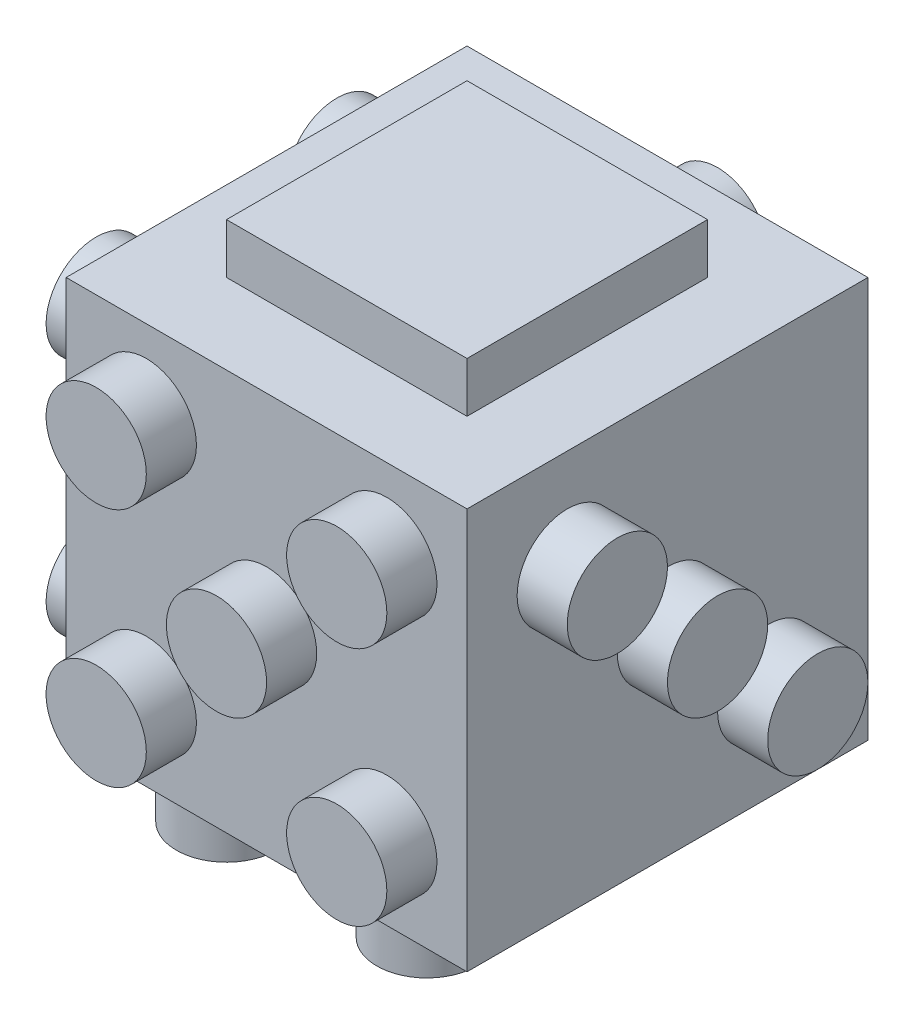
ISO-10303-21;
HEADER;
FILE_DESCRIPTION(('STEP AP214'),'2;1');
FILE_NAME('part.step','',(''),(''),'','','');
FILE_SCHEMA(('AUTOMOTIVE_DESIGN { 1 0 10303 214 1 1 1 1 }'));
ENDSEC;
DATA;
#1=APPLICATION_CONTEXT('core data for automotive mechanical design processes');
#2=APPLICATION_PROTOCOL_DEFINITION('international standard','automotive_design',2000,#1);
#3=PRODUCT_CONTEXT('',#1,'mechanical');
#4=PRODUCT('Part','Part','',(#3));
#5=PRODUCT_RELATED_PRODUCT_CATEGORY('part','',(#4));
#6=PRODUCT_DEFINITION_FORMATION('','',#4);
#7=PRODUCT_DEFINITION_CONTEXT('part definition',#1,'design');
#8=PRODUCT_DEFINITION('design','',#6,#7);
#9=PRODUCT_DEFINITION_SHAPE('','',#8);
#10=(LENGTH_UNIT() NAMED_UNIT(*) SI_UNIT(.MILLI.,.METRE.));
#11=(NAMED_UNIT(*) PLANE_ANGLE_UNIT() SI_UNIT($,.RADIAN.));
#12=(NAMED_UNIT(*) SI_UNIT($,.STERADIAN.) SOLID_ANGLE_UNIT());
#13=UNCERTAINTY_MEASURE_WITH_UNIT(LENGTH_MEASURE(1.E-05),#10,'distance_accuracy_value','');
#14=(GEOMETRIC_REPRESENTATION_CONTEXT(3) GLOBAL_UNCERTAINTY_ASSIGNED_CONTEXT((#13)) GLOBAL_UNIT_ASSIGNED_CONTEXT((#10,
#11,#12)) REPRESENTATION_CONTEXT('',''));
#15=CARTESIAN_POINT('',(0.,0.,0.));
#16=DIRECTION('',(0.,0.,1.));
#17=DIRECTION('',(1.,0.,0.));
#18=AXIS2_PLACEMENT_3D('',#15,#16,#17);
#19=CARTESIAN_POINT('',(0.,2.5,0.));
#20=DIRECTION('',(0.,1.,0.));
#21=DIRECTION('',(0.,0.,1.));
#22=AXIS2_PLACEMENT_3D('',#19,#20,#21);
#23=PLANE('',#22);
#24=CARTESIAN_POINT('',(5.,2.5,7.));
#25=DIRECTION('',(0.,1.,0.));
#26=DIRECTION('',(0.,0.,1.));
#27=AXIS2_PLACEMENT_3D('',#24,#25,#26);
#28=CIRCLE('',#27,2.5);
#29=CARTESIAN_POINT('',(5.,2.5,9.5));
#30=VERTEX_POINT('',#29);
#31=EDGE_CURVE('E55',#30,#30,#28,.F.);
#32=ORIENTED_EDGE('',*,*,#31,.F.);
#33=EDGE_LOOP('',(#32));
#34=FACE_BOUND('',#33,.T.);
#35=ADVANCED_FACE('F48',(#34),#23,.T.);
#36=CARTESIAN_POINT('',(5.,0.,7.));
#37=DIRECTION('',(0.,-1.,0.));
#38=DIRECTION('',(0.,0.,-1.));
#39=AXIS2_PLACEMENT_3D('',#36,#37,#38);
#40=PLANE('',#39);
#41=CARTESIAN_POINT('',(5.,0.,7.));
#42=DIRECTION('',(0.,-1.,0.));
#43=DIRECTION('',(0.,0.,-1.));
#44=AXIS2_PLACEMENT_3D('',#41,#42,#43);
#45=CIRCLE('',#44,2.5);
#46=CARTESIAN_POINT('',(5.,0.,4.5));
#47=VERTEX_POINT('',#46);
#48=EDGE_CURVE('E11',#47,#47,#45,.T.);
#49=ORIENTED_EDGE('',*,*,#48,.T.);
#50=EDGE_LOOP('',(#49));
#51=FACE_BOUND('',#50,.T.);
#52=ADVANCED_FACE('F50',(#51),#40,.T.);
#53=CARTESIAN_POINT('',(5.,9.57106781186548,7.));
#54=DIRECTION('',(0.,-1.,0.));
#55=DIRECTION('',(0.,0.,-1.));
#56=AXIS2_PLACEMENT_3D('',#53,#54,#55);
#57=CYLINDRICAL_SURFACE('',#56,2.5);
#58=ORIENTED_EDGE('',*,*,#48,.F.);
#59=EDGE_LOOP('',(#58));
#60=FACE_BOUND('',#59,.T.);
#61=ORIENTED_EDGE('',*,*,#31,.T.);
#62=EDGE_LOOP('',(#61));
#63=FACE_BOUND('',#62,.T.);
#64=ADVANCED_FACE('F61',(#60,#63),#57,.T.);
#65=CLOSED_SHELL('',(#35,#52,#64));
#66=MANIFOLD_SOLID_BREP('B2',#65);
#67=CARTESIAN_POINT('',(0.,2.5,0.));
#68=DIRECTION('',(0.,1.,0.));
#69=DIRECTION('',(0.,0.,1.));
#70=AXIS2_PLACEMENT_3D('',#67,#68,#69);
#71=PLANE('',#70);
#72=CARTESIAN_POINT('',(5.,2.5,0.));
#73=DIRECTION('',(0.,1.,0.));
#74=DIRECTION('',(0.,0.,1.));
#75=AXIS2_PLACEMENT_3D('',#72,#73,#74);
#76=CIRCLE('',#75,2.5);
#77=CARTESIAN_POINT('',(5.,2.5,2.5));
#78=VERTEX_POINT('',#77);
#79=EDGE_CURVE('E104',#78,#78,#76,.F.);
#80=ORIENTED_EDGE('',*,*,#79,.F.);
#81=EDGE_LOOP('',(#80));
#82=FACE_BOUND('',#81,.T.);
#83=ADVANCED_FACE('F97',(#82),#71,.T.);
#84=CARTESIAN_POINT('',(5.,0.,0.));
#85=DIRECTION('',(0.,-1.,0.));
#86=DIRECTION('',(0.,0.,-1.));
#87=AXIS2_PLACEMENT_3D('',#84,#85,#86);
#88=PLANE('',#87);
#89=CARTESIAN_POINT('',(5.,0.,0.));
#90=DIRECTION('',(0.,-1.,0.));
#91=DIRECTION('',(0.,0.,-1.));
#92=AXIS2_PLACEMENT_3D('',#89,#90,#91);
#93=CIRCLE('',#92,2.5);
#94=CARTESIAN_POINT('',(5.,0.,-2.5));
#95=VERTEX_POINT('',#94);
#96=EDGE_CURVE('E47',#95,#95,#93,.T.);
#97=ORIENTED_EDGE('',*,*,#96,.T.);
#98=EDGE_LOOP('',(#97));
#99=FACE_BOUND('',#98,.T.);
#100=ADVANCED_FACE('F99',(#99),#88,.T.);
#101=CARTESIAN_POINT('',(5.,9.57106781186548,0.));
#102=DIRECTION('',(0.,-1.,0.));
#103=DIRECTION('',(0.,0.,-1.));
#104=AXIS2_PLACEMENT_3D('',#101,#102,#103);
#105=CYLINDRICAL_SURFACE('',#104,2.5);
#106=ORIENTED_EDGE('',*,*,#96,.F.);
#107=EDGE_LOOP('',(#106));
#108=FACE_BOUND('',#107,.T.);
#109=ORIENTED_EDGE('',*,*,#79,.T.);
#110=EDGE_LOOP('',(#109));
#111=FACE_BOUND('',#110,.T.);
#112=ADVANCED_FACE('F110',(#108,#111),#105,.T.);
#113=CLOSED_SHELL('',(#83,#100,#112));
#114=MANIFOLD_SOLID_BREP('B6',#113);
#115=CARTESIAN_POINT('',(0.,2.5,0.));
#116=DIRECTION('',(0.,1.,0.));
#117=DIRECTION('',(0.,0.,1.));
#118=AXIS2_PLACEMENT_3D('',#115,#116,#117);
#119=PLANE('',#118);
#120=CARTESIAN_POINT('',(5.,2.5,-7.));
#121=DIRECTION('',(0.,1.,0.));
#122=DIRECTION('',(0.,0.,1.));
#123=AXIS2_PLACEMENT_3D('',#120,#121,#122);
#124=CIRCLE('',#123,2.5);
#125=CARTESIAN_POINT('',(5.,2.5,-4.5));
#126=VERTEX_POINT('',#125);
#127=EDGE_CURVE('E153',#126,#126,#124,.F.);
#128=ORIENTED_EDGE('',*,*,#127,.F.);
#129=EDGE_LOOP('',(#128));
#130=FACE_BOUND('',#129,.T.);
#131=ADVANCED_FACE('F146',(#130),#119,.T.);
#132=CARTESIAN_POINT('',(5.,0.,-7.));
#133=DIRECTION('',(0.,-1.,0.));
#134=DIRECTION('',(0.,0.,-1.));
#135=AXIS2_PLACEMENT_3D('',#132,#133,#134);
#136=PLANE('',#135);
#137=CARTESIAN_POINT('',(5.,0.,-7.));
#138=DIRECTION('',(0.,-1.,0.));
#139=DIRECTION('',(0.,0.,-1.));
#140=AXIS2_PLACEMENT_3D('',#137,#138,#139);
#141=CIRCLE('',#140,2.5);
#142=CARTESIAN_POINT('',(5.,0.,-9.5));
#143=VERTEX_POINT('',#142);
#144=EDGE_CURVE('E96',#143,#143,#141,.T.);
#145=ORIENTED_EDGE('',*,*,#144,.T.);
#146=EDGE_LOOP('',(#145));
#147=FACE_BOUND('',#146,.T.);
#148=ADVANCED_FACE('F148',(#147),#136,.T.);
#149=CARTESIAN_POINT('',(5.,9.57106781186548,-7.));
#150=DIRECTION('',(0.,-1.,0.));
#151=DIRECTION('',(0.,0.,-1.));
#152=AXIS2_PLACEMENT_3D('',#149,#150,#151);
#153=CYLINDRICAL_SURFACE('',#152,2.5);
#154=ORIENTED_EDGE('',*,*,#144,.F.);
#155=EDGE_LOOP('',(#154));
#156=FACE_BOUND('',#155,.T.);
#157=ORIENTED_EDGE('',*,*,#127,.T.);
#158=EDGE_LOOP('',(#157));
#159=FACE_BOUND('',#158,.T.);
#160=ADVANCED_FACE('F159',(#156,#159),#153,.T.);
#161=CLOSED_SHELL('',(#131,#148,#160));
#162=MANIFOLD_SOLID_BREP('B42',#161);
#163=CARTESIAN_POINT('',(0.,2.5,0.));
#164=DIRECTION('',(0.,1.,0.));
#165=DIRECTION('',(0.,0.,1.));
#166=AXIS2_PLACEMENT_3D('',#163,#164,#165);
#167=PLANE('',#166);
#168=CARTESIAN_POINT('',(-5.,2.5,7.));
#169=DIRECTION('',(0.,1.,0.));
#170=DIRECTION('',(0.,0.,1.));
#171=AXIS2_PLACEMENT_3D('',#168,#169,#170);
#172=CIRCLE('',#171,2.5);
#173=CARTESIAN_POINT('',(-5.,2.5,9.5));
#174=VERTEX_POINT('',#173);
#175=EDGE_CURVE('E202',#174,#174,#172,.F.);
#176=ORIENTED_EDGE('',*,*,#175,.F.);
#177=EDGE_LOOP('',(#176));
#178=FACE_BOUND('',#177,.T.);
#179=ADVANCED_FACE('F195',(#178),#167,.T.);
#180=CARTESIAN_POINT('',(-5.,0.,7.));
#181=DIRECTION('',(0.,-1.,0.));
#182=DIRECTION('',(0.,0.,-1.));
#183=AXIS2_PLACEMENT_3D('',#180,#181,#182);
#184=PLANE('',#183);
#185=CARTESIAN_POINT('',(-5.,0.,7.));
#186=DIRECTION('',(0.,-1.,0.));
#187=DIRECTION('',(0.,0.,-1.));
#188=AXIS2_PLACEMENT_3D('',#185,#186,#187);
#189=CIRCLE('',#188,2.5);
#190=CARTESIAN_POINT('',(-5.,0.,4.5));
#191=VERTEX_POINT('',#190);
#192=EDGE_CURVE('E145',#191,#191,#189,.T.);
#193=ORIENTED_EDGE('',*,*,#192,.T.);
#194=EDGE_LOOP('',(#193));
#195=FACE_BOUND('',#194,.T.);
#196=ADVANCED_FACE('F197',(#195),#184,.T.);
#197=CARTESIAN_POINT('',(-5.,9.57106781186548,7.));
#198=DIRECTION('',(0.,-1.,0.));
#199=DIRECTION('',(0.,0.,-1.));
#200=AXIS2_PLACEMENT_3D('',#197,#198,#199);
#201=CYLINDRICAL_SURFACE('',#200,2.5);
#202=ORIENTED_EDGE('',*,*,#192,.F.);
#203=EDGE_LOOP('',(#202));
#204=FACE_BOUND('',#203,.T.);
#205=ORIENTED_EDGE('',*,*,#175,.T.);
#206=EDGE_LOOP('',(#205));
#207=FACE_BOUND('',#206,.T.);
#208=ADVANCED_FACE('F208',(#204,#207),#201,.T.);
#209=CLOSED_SHELL('',(#179,#196,#208));
#210=MANIFOLD_SOLID_BREP('B91',#209);
#211=CARTESIAN_POINT('',(0.,2.5,0.));
#212=DIRECTION('',(0.,1.,0.));
#213=DIRECTION('',(0.,0.,1.));
#214=AXIS2_PLACEMENT_3D('',#211,#212,#213);
#215=PLANE('',#214);
#216=CARTESIAN_POINT('',(-5.,2.5,0.));
#217=DIRECTION('',(0.,1.,0.));
#218=DIRECTION('',(0.,0.,1.));
#219=AXIS2_PLACEMENT_3D('',#216,#217,#218);
#220=CIRCLE('',#219,2.5);
#221=CARTESIAN_POINT('',(-5.,2.5,2.5));
#222=VERTEX_POINT('',#221);
#223=EDGE_CURVE('E251',#222,#222,#220,.F.);
#224=ORIENTED_EDGE('',*,*,#223,.F.);
#225=EDGE_LOOP('',(#224));
#226=FACE_BOUND('',#225,.T.);
#227=ADVANCED_FACE('F244',(#226),#215,.T.);
#228=CARTESIAN_POINT('',(-5.,0.,0.));
#229=DIRECTION('',(0.,-1.,0.));
#230=DIRECTION('',(0.,0.,-1.));
#231=AXIS2_PLACEMENT_3D('',#228,#229,#230);
#232=PLANE('',#231);
#233=CARTESIAN_POINT('',(-5.,0.,0.));
#234=DIRECTION('',(0.,-1.,0.));
#235=DIRECTION('',(0.,0.,-1.));
#236=AXIS2_PLACEMENT_3D('',#233,#234,#235);
#237=CIRCLE('',#236,2.5);
#238=CARTESIAN_POINT('',(-5.,0.,-2.5));
#239=VERTEX_POINT('',#238);
#240=EDGE_CURVE('E194',#239,#239,#237,.T.);
#241=ORIENTED_EDGE('',*,*,#240,.T.);
#242=EDGE_LOOP('',(#241));
#243=FACE_BOUND('',#242,.T.);
#244=ADVANCED_FACE('F246',(#243),#232,.T.);
#245=CARTESIAN_POINT('',(-5.,9.57106781186548,0.));
#246=DIRECTION('',(0.,-1.,0.));
#247=DIRECTION('',(0.,0.,-1.));
#248=AXIS2_PLACEMENT_3D('',#245,#246,#247);
#249=CYLINDRICAL_SURFACE('',#248,2.5);
#250=ORIENTED_EDGE('',*,*,#240,.F.);
#251=EDGE_LOOP('',(#250));
#252=FACE_BOUND('',#251,.T.);
#253=ORIENTED_EDGE('',*,*,#223,.T.);
#254=EDGE_LOOP('',(#253));
#255=FACE_BOUND('',#254,.T.);
#256=ADVANCED_FACE('F257',(#252,#255),#249,.T.);
#257=CLOSED_SHELL('',(#227,#244,#256));
#258=MANIFOLD_SOLID_BREP('B140',#257);
#259=CARTESIAN_POINT('',(0.,2.5,0.));
#260=DIRECTION('',(0.,1.,0.));
#261=DIRECTION('',(0.,0.,1.));
#262=AXIS2_PLACEMENT_3D('',#259,#260,#261);
#263=PLANE('',#262);
#264=CARTESIAN_POINT('',(-5.,2.5,-7.));
#265=DIRECTION('',(0.,1.,0.));
#266=DIRECTION('',(0.,0.,1.));
#267=AXIS2_PLACEMENT_3D('',#264,#265,#266);
#268=CIRCLE('',#267,2.5);
#269=CARTESIAN_POINT('',(-5.,2.5,-4.5));
#270=VERTEX_POINT('',#269);
#271=EDGE_CURVE('E243',#270,#270,#268,.F.);
#272=ORIENTED_EDGE('',*,*,#271,.F.);
#273=EDGE_LOOP('',(#272));
#274=FACE_BOUND('',#273,.T.);
#275=ADVANCED_FACE('F294',(#274),#263,.T.);
#276=CARTESIAN_POINT('',(-5.,0.,-7.));
#277=DIRECTION('',(0.,-1.,0.));
#278=DIRECTION('',(0.,0.,-1.));
#279=AXIS2_PLACEMENT_3D('',#276,#277,#278);
#280=PLANE('',#279);
#281=CARTESIAN_POINT('',(-5.,0.,-7.));
#282=DIRECTION('',(0.,-1.,0.));
#283=DIRECTION('',(0.,0.,-1.));
#284=AXIS2_PLACEMENT_3D('',#281,#282,#283);
#285=CIRCLE('',#284,2.5);
#286=CARTESIAN_POINT('',(-5.,0.,-9.5));
#287=VERTEX_POINT('',#286);
#288=EDGE_CURVE('E300',#287,#287,#285,.T.);
#289=ORIENTED_EDGE('',*,*,#288,.T.);
#290=EDGE_LOOP('',(#289));
#291=FACE_BOUND('',#290,.T.);
#292=ADVANCED_FACE('F306',(#291),#280,.T.);
#293=CARTESIAN_POINT('',(-5.,9.57106781186548,-7.));
#294=DIRECTION('',(0.,-1.,0.));
#295=DIRECTION('',(0.,0.,-1.));
#296=AXIS2_PLACEMENT_3D('',#293,#294,#295);
#297=CYLINDRICAL_SURFACE('',#296,2.5);
#298=ORIENTED_EDGE('',*,*,#288,.F.);
#299=EDGE_LOOP('',(#298));
#300=FACE_BOUND('',#299,.T.);
#301=ORIENTED_EDGE('',*,*,#271,.T.);
#302=EDGE_LOOP('',(#301));
#303=FACE_BOUND('',#302,.T.);
#304=ADVANCED_FACE('F308',(#300,#303),#297,.T.);
#305=CLOSED_SHELL('',(#275,#292,#304));
#306=MANIFOLD_SOLID_BREP('B189',#305);
#307=CARTESIAN_POINT('',(10.,22.5,-10.));
#308=DIRECTION('',(-1.,0.,0.));
#309=DIRECTION('',(0.,0.,1.));
#310=AXIS2_PLACEMENT_3D('',#307,#308,#309);
#311=PLANE('',#310);
#312=CARTESIAN_POINT('',(10.,17.5,5.));
#313=DIRECTION('',(-1.,0.,0.));
#314=DIRECTION('',(0.,0.,1.));
#315=AXIS2_PLACEMENT_3D('',#312,#313,#314);
#316=CIRCLE('',#315,2.5);
#317=CARTESIAN_POINT('',(10.,17.5,7.5));
#318=VERTEX_POINT('',#317);
#319=EDGE_CURVE('E439',#318,#318,#316,.F.);
#320=ORIENTED_EDGE('',*,*,#319,.F.);
#321=EDGE_LOOP('',(#320));
#322=FACE_BOUND('',#321,.T.);
#323=CARTESIAN_POINT('',(10.,12.5,0.));
#324=DIRECTION('',(-1.,0.,0.));
#325=DIRECTION('',(0.,0.,1.));
#326=AXIS2_PLACEMENT_3D('',#323,#324,#325);
#327=CIRCLE('',#326,2.5);
#328=CARTESIAN_POINT('',(10.,12.5,2.5));
#329=VERTEX_POINT('',#328);
#330=EDGE_CURVE('E445',#329,#329,#327,.F.);
#331=ORIENTED_EDGE('',*,*,#330,.F.);
#332=EDGE_LOOP('',(#331));
#333=FACE_BOUND('',#332,.T.);
#334=CARTESIAN_POINT('',(10.,7.50000000000005,-5.));
#335=DIRECTION('',(-1.,0.,0.));
#336=DIRECTION('',(0.,0.,1.));
#337=AXIS2_PLACEMENT_3D('',#334,#335,#336);
#338=CIRCLE('',#337,2.5);
#339=CARTESIAN_POINT('',(10.,7.50000000000005,-2.5));
#340=VERTEX_POINT('',#339);
#341=EDGE_CURVE('E454',#340,#340,#338,.F.);
#342=ORIENTED_EDGE('',*,*,#341,.F.);
#343=EDGE_LOOP('',(#342));
#344=FACE_BOUND('',#343,.T.);
#345=DIRECTION('',(0.,0.,-1.));
#346=VECTOR('',#345,1.);
#347=CARTESIAN_POINT('',(10.,2.5,-10.));
#348=LINE('',#347,#346);
#349=CARTESIAN_POINT('',(10.,2.5,10.));
#350=VERTEX_POINT('',#349);
#351=CARTESIAN_POINT('',(10.,2.5,-10.));
#352=VERTEX_POINT('',#351);
#353=EDGE_CURVE('E511',#350,#352,#348,.T.);
#354=ORIENTED_EDGE('',*,*,#353,.T.);
#355=DIRECTION('',(0.,-1.,0.));
#356=VECTOR('',#355,1.);
#357=CARTESIAN_POINT('',(10.,22.5,-10.));
#358=LINE('',#357,#356);
#359=CARTESIAN_POINT('',(10.,22.5,-10.));
#360=VERTEX_POINT('',#359);
#361=EDGE_CURVE('E292',#360,#352,#358,.T.);
#362=ORIENTED_EDGE('',*,*,#361,.F.);
#363=DIRECTION('',(0.,0.,-1.));
#364=VECTOR('',#363,1.);
#365=CARTESIAN_POINT('',(10.,22.5,-10.));
#366=LINE('',#365,#364);
#367=CARTESIAN_POINT('',(10.,22.5,10.));
#368=VERTEX_POINT('',#367);
#369=EDGE_CURVE('E512',#368,#360,#366,.T.);
#370=ORIENTED_EDGE('',*,*,#369,.F.);
#371=DIRECTION('',(0.,-1.,0.));
#372=VECTOR('',#371,1.);
#373=CARTESIAN_POINT('',(10.,22.5,10.));
#374=LINE('',#373,#372);
#375=EDGE_CURVE('E522',#368,#350,#374,.T.);
#376=ORIENTED_EDGE('',*,*,#375,.T.);
#377=EDGE_LOOP('',(#354,#362,#370,#376));
#378=FACE_BOUND('',#377,.T.);
#379=ADVANCED_FACE('F335',(#322,#333,#344,#378),#311,.F.);
#380=CARTESIAN_POINT('',(-10.,22.5,-10.));
#381=DIRECTION('',(0.,0.,1.));
#382=DIRECTION('',(1.,0.,0.));
#383=AXIS2_PLACEMENT_3D('',#380,#381,#382);
#384=PLANE('',#383);
#385=CARTESIAN_POINT('',(0.,18.5,-10.));
#386=DIRECTION('',(0.,0.,1.));
#387=DIRECTION('',(1.,0.,0.));
#388=AXIS2_PLACEMENT_3D('',#385,#386,#387);
#389=CIRCLE('',#388,2.5);
#390=CARTESIAN_POINT('',(2.5,18.5,-10.));
#391=VERTEX_POINT('',#390);
#392=EDGE_CURVE('E338',#391,#391,#389,.T.);
#393=ORIENTED_EDGE('',*,*,#392,.T.);
#394=EDGE_LOOP('',(#393));
#395=FACE_BOUND('',#394,.T.);
#396=CARTESIAN_POINT('',(0.,6.5,-10.));
#397=DIRECTION('',(0.,0.,1.));
#398=DIRECTION('',(1.,0.,0.));
#399=AXIS2_PLACEMENT_3D('',#396,#397,#398);
#400=CIRCLE('',#399,2.5);
#401=CARTESIAN_POINT('',(2.5,6.5,-10.));
#402=VERTEX_POINT('',#401);
#403=EDGE_CURVE('E422',#402,#402,#400,.T.);
#404=ORIENTED_EDGE('',*,*,#403,.T.);
#405=EDGE_LOOP('',(#404));
#406=FACE_BOUND('',#405,.T.);
#407=DIRECTION('',(-1.,0.,0.));
#408=VECTOR('',#407,1.);
#409=CARTESIAN_POINT('',(-10.,2.5,-10.));
#410=LINE('',#409,#408);
#411=CARTESIAN_POINT('',(-10.,2.5,-10.));
#412=VERTEX_POINT('',#411);
#413=EDGE_CURVE('E525',#352,#412,#410,.T.);
#414=ORIENTED_EDGE('',*,*,#413,.T.);
#415=DIRECTION('',(0.,-1.,0.));
#416=VECTOR('',#415,1.);
#417=CARTESIAN_POINT('',(-10.,22.5,-10.));
#418=LINE('',#417,#416);
#419=CARTESIAN_POINT('',(-10.,22.5,-10.));
#420=VERTEX_POINT('',#419);
#421=EDGE_CURVE('E343',#420,#412,#418,.T.);
#422=ORIENTED_EDGE('',*,*,#421,.F.);
#423=DIRECTION('',(-1.,0.,0.));
#424=VECTOR('',#423,1.);
#425=CARTESIAN_POINT('',(-10.,22.5,-10.));
#426=LINE('',#425,#424);
#427=EDGE_CURVE('E515',#360,#420,#426,.T.);
#428=ORIENTED_EDGE('',*,*,#427,.F.);
#429=ORIENTED_EDGE('',*,*,#361,.T.);
#430=EDGE_LOOP('',(#414,#422,#428,#429));
#431=FACE_BOUND('',#430,.T.);
#432=ADVANCED_FACE('F556',(#395,#406,#431),#384,.F.);
#433=CARTESIAN_POINT('',(-10.,22.5,-10.));
#434=DIRECTION('',(1.,0.,0.));
#435=DIRECTION('',(0.,0.,-1.));
#436=AXIS2_PLACEMENT_3D('',#433,#434,#435);
#437=PLANE('',#436);
#438=CARTESIAN_POINT('',(-10.,18.5,-6.));
#439=DIRECTION('',(1.,0.,0.));
#440=DIRECTION('',(0.,0.,-1.));
#441=AXIS2_PLACEMENT_3D('',#438,#439,#440);
#442=CIRCLE('',#441,2.5);
#443=CARTESIAN_POINT('',(-10.,18.5,-8.5));
#444=VERTEX_POINT('',#443);
#445=EDGE_CURVE('E457',#444,#444,#442,.F.);
#446=ORIENTED_EDGE('',*,*,#445,.F.);
#447=EDGE_LOOP('',(#446));
#448=FACE_BOUND('',#447,.T.);
#449=CARTESIAN_POINT('',(-10.,18.5,6.));
#450=DIRECTION('',(1.,0.,0.));
#451=DIRECTION('',(0.,0.,-1.));
#452=AXIS2_PLACEMENT_3D('',#449,#450,#451);
#453=CIRCLE('',#452,2.5);
#454=CARTESIAN_POINT('',(-10.,18.5,3.5));
#455=VERTEX_POINT('',#454);
#456=EDGE_CURVE('E463',#455,#455,#453,.F.);
#457=ORIENTED_EDGE('',*,*,#456,.F.);
#458=EDGE_LOOP('',(#457));
#459=FACE_BOUND('',#458,.T.);
#460=CARTESIAN_POINT('',(-10.,6.5,6.));
#461=DIRECTION('',(1.,0.,0.));
#462=DIRECTION('',(0.,0.,-1.));
#463=AXIS2_PLACEMENT_3D('',#460,#461,#462);
#464=CIRCLE('',#463,2.5);
#465=CARTESIAN_POINT('',(-10.,6.5,3.5));
#466=VERTEX_POINT('',#465);
#467=EDGE_CURVE('E469',#466,#466,#464,.F.);
#468=ORIENTED_EDGE('',*,*,#467,.F.);
#469=EDGE_LOOP('',(#468));
#470=FACE_BOUND('',#469,.T.);
#471=CARTESIAN_POINT('',(-10.,6.5,-6.));
#472=DIRECTION('',(1.,0.,0.));
#473=DIRECTION('',(0.,0.,-1.));
#474=AXIS2_PLACEMENT_3D('',#471,#472,#473);
#475=CIRCLE('',#474,2.5);
#476=CARTESIAN_POINT('',(-10.,6.5,-8.5));
#477=VERTEX_POINT('',#476);
#478=EDGE_CURVE('E478',#477,#477,#475,.F.);
#479=ORIENTED_EDGE('',*,*,#478,.F.);
#480=EDGE_LOOP('',(#479));
#481=FACE_BOUND('',#480,.T.);
#482=DIRECTION('',(0.,0.,1.));
#483=VECTOR('',#482,1.);
#484=CARTESIAN_POINT('',(-10.,2.5,-10.));
#485=LINE('',#484,#483);
#486=CARTESIAN_POINT('',(-10.,2.5,10.));
#487=VERTEX_POINT('',#486);
#488=EDGE_CURVE('E527',#412,#487,#485,.T.);
#489=ORIENTED_EDGE('',*,*,#488,.T.);
#490=DIRECTION('',(0.,-1.,0.));
#491=VECTOR('',#490,1.);
#492=CARTESIAN_POINT('',(-10.,22.5,10.));
#493=LINE('',#492,#491);
#494=CARTESIAN_POINT('',(-10.,22.5,10.));
#495=VERTEX_POINT('',#494);
#496=EDGE_CURVE('E532',#495,#487,#493,.T.);
#497=ORIENTED_EDGE('',*,*,#496,.F.);
#498=DIRECTION('',(0.,0.,1.));
#499=VECTOR('',#498,1.);
#500=CARTESIAN_POINT('',(-10.,22.5,-10.));
#501=LINE('',#500,#499);
#502=EDGE_CURVE('E518',#420,#495,#501,.T.);
#503=ORIENTED_EDGE('',*,*,#502,.F.);
#504=ORIENTED_EDGE('',*,*,#421,.T.);
#505=EDGE_LOOP('',(#489,#497,#503,#504));
#506=FACE_BOUND('',#505,.T.);
#507=ADVANCED_FACE('F540',(#448,#459,#470,#481,#506),#437,.F.);
#508=CARTESIAN_POINT('',(-10.,22.5,10.));
#509=DIRECTION('',(0.,0.,-1.));
#510=DIRECTION('',(-1.,0.,0.));
#511=AXIS2_PLACEMENT_3D('',#508,#509,#510);
#512=PLANE('',#511);
#513=CARTESIAN_POINT('',(5.99999999999999,6.5,10.));
#514=DIRECTION('',(0.,0.,-1.));
#515=DIRECTION('',(-1.,0.,0.));
#516=AXIS2_PLACEMENT_3D('',#513,#514,#515);
#517=CIRCLE('',#516,2.5);
#518=CARTESIAN_POINT('',(3.5,6.5,10.));
#519=VERTEX_POINT('',#518);
#520=EDGE_CURVE('E481',#519,#519,#517,.F.);
#521=ORIENTED_EDGE('',*,*,#520,.F.);
#522=EDGE_LOOP('',(#521));
#523=FACE_BOUND('',#522,.T.);
#524=CARTESIAN_POINT('',(-6.00000000000001,6.5,10.));
#525=DIRECTION('',(0.,0.,-1.));
#526=DIRECTION('',(-1.,0.,0.));
#527=AXIS2_PLACEMENT_3D('',#524,#525,#526);
#528=CIRCLE('',#527,2.5);
#529=CARTESIAN_POINT('',(-8.50000000000001,6.5,10.));
#530=VERTEX_POINT('',#529);
#531=EDGE_CURVE('E487',#530,#530,#528,.F.);
#532=ORIENTED_EDGE('',*,*,#531,.F.);
#533=EDGE_LOOP('',(#532));
#534=FACE_BOUND('',#533,.T.);
#535=CARTESIAN_POINT('',(0.,12.5,10.));
#536=DIRECTION('',(0.,0.,-1.));
#537=DIRECTION('',(-1.,0.,0.));
#538=AXIS2_PLACEMENT_3D('',#535,#536,#537);
#539=CIRCLE('',#538,2.5);
#540=CARTESIAN_POINT('',(-2.5,12.5,10.));
#541=VERTEX_POINT('',#540);
#542=EDGE_CURVE('E493',#541,#541,#539,.F.);
#543=ORIENTED_EDGE('',*,*,#542,.F.);
#544=EDGE_LOOP('',(#543));
#545=FACE_BOUND('',#544,.T.);
#546=CARTESIAN_POINT('',(5.99999999999999,18.5,10.));
#547=DIRECTION('',(0.,0.,-1.));
#548=DIRECTION('',(-1.,0.,0.));
#549=AXIS2_PLACEMENT_3D('',#546,#547,#548);
#550=CIRCLE('',#549,2.5);
#551=CARTESIAN_POINT('',(3.5,18.5,10.));
#552=VERTEX_POINT('',#551);
#553=EDGE_CURVE('E499',#552,#552,#550,.F.);
#554=ORIENTED_EDGE('',*,*,#553,.F.);
#555=EDGE_LOOP('',(#554));
#556=FACE_BOUND('',#555,.T.);
#557=CARTESIAN_POINT('',(-6.00000000000001,18.5,10.));
#558=DIRECTION('',(0.,0.,-1.));
#559=DIRECTION('',(-1.,0.,0.));
#560=AXIS2_PLACEMENT_3D('',#557,#558,#559);
#561=CIRCLE('',#560,2.5);
#562=CARTESIAN_POINT('',(-8.50000000000001,18.5,10.));
#563=VERTEX_POINT('',#562);
#564=EDGE_CURVE('E508',#563,#563,#561,.F.);
#565=ORIENTED_EDGE('',*,*,#564,.F.);
#566=EDGE_LOOP('',(#565));
#567=FACE_BOUND('',#566,.T.);
#568=DIRECTION('',(1.,0.,0.));
#569=VECTOR('',#568,1.);
#570=CARTESIAN_POINT('',(-10.,2.5,10.));
#571=LINE('',#570,#569);
#572=EDGE_CURVE('E516',#487,#350,#571,.T.);
#573=ORIENTED_EDGE('',*,*,#572,.T.);
#574=ORIENTED_EDGE('',*,*,#375,.F.);
#575=DIRECTION('',(1.,0.,0.));
#576=VECTOR('',#575,1.);
#577=CARTESIAN_POINT('',(-10.,22.5,10.));
#578=LINE('',#577,#576);
#579=EDGE_CURVE('E520',#495,#368,#578,.T.);
#580=ORIENTED_EDGE('',*,*,#579,.F.);
#581=ORIENTED_EDGE('',*,*,#496,.T.);
#582=EDGE_LOOP('',(#573,#574,#580,#581));
#583=FACE_BOUND('',#582,.T.);
#584=ADVANCED_FACE('F549',(#523,#534,#545,#556,#567,#583),#512,.F.);
#585=CARTESIAN_POINT('',(0.,22.5,0.));
#586=DIRECTION('',(0.,1.,0.));
#587=DIRECTION('',(0.,0.,1.));
#588=AXIS2_PLACEMENT_3D('',#585,#586,#587);
#589=PLANE('',#588);
#590=DIRECTION('',(0.,0.,-1.));
#591=VECTOR('',#590,1.);
#592=CARTESIAN_POINT('',(6.,22.5,-6.));
#593=LINE('',#592,#591);
#594=CARTESIAN_POINT('',(6.,22.5,6.));
#595=VERTEX_POINT('',#594);
#596=CARTESIAN_POINT('',(6.,22.5,-6.));
#597=VERTEX_POINT('',#596);
#598=EDGE_CURVE('E351',#595,#597,#593,.T.);
#599=ORIENTED_EDGE('',*,*,#598,.F.);
#600=DIRECTION('',(-1.,0.,0.));
#601=VECTOR('',#600,1.);
#602=CARTESIAN_POINT('',(-6.,22.5,6.));
#603=LINE('',#602,#601);
#604=CARTESIAN_POINT('',(-6.,22.5,6.));
#605=VERTEX_POINT('',#604);
#606=EDGE_CURVE('E355',#595,#605,#603,.T.);
#607=ORIENTED_EDGE('',*,*,#606,.T.);
#608=DIRECTION('',(0.,0.,-1.));
#609=VECTOR('',#608,1.);
#610=CARTESIAN_POINT('',(-6.,22.5,-6.));
#611=LINE('',#610,#609);
#612=CARTESIAN_POINT('',(-6.,22.5,-6.));
#613=VERTEX_POINT('',#612);
#614=EDGE_CURVE('E437',#605,#613,#611,.T.);
#615=ORIENTED_EDGE('',*,*,#614,.T.);
#616=DIRECTION('',(-1.,0.,0.));
#617=VECTOR('',#616,1.);
#618=CARTESIAN_POINT('',(-6.,22.5,-6.));
#619=LINE('',#618,#617);
#620=EDGE_CURVE('E427',#597,#613,#619,.T.);
#621=ORIENTED_EDGE('',*,*,#620,.F.);
#622=EDGE_LOOP('',(#599,#607,#615,#621));
#623=FACE_BOUND('',#622,.T.);
#624=ORIENTED_EDGE('',*,*,#369,.T.);
#625=ORIENTED_EDGE('',*,*,#427,.T.);
#626=ORIENTED_EDGE('',*,*,#502,.T.);
#627=ORIENTED_EDGE('',*,*,#579,.T.);
#628=EDGE_LOOP('',(#624,#625,#626,#627));
#629=FACE_BOUND('',#628,.T.);
#630=ADVANCED_FACE('F555',(#623,#629),#589,.T.);
#631=CARTESIAN_POINT('',(0.,2.5,0.));
#632=DIRECTION('',(0.,1.,0.));
#633=DIRECTION('',(0.,0.,1.));
#634=AXIS2_PLACEMENT_3D('',#631,#632,#633);
#635=PLANE('',#634);
#636=ORIENTED_EDGE('',*,*,#353,.F.);
#637=ORIENTED_EDGE('',*,*,#572,.F.);
#638=ORIENTED_EDGE('',*,*,#488,.F.);
#639=ORIENTED_EDGE('',*,*,#413,.F.);
#640=EDGE_LOOP('',(#636,#637,#638,#639));
#641=FACE_BOUND('',#640,.T.);
#642=ADVANCED_FACE('F546',(#641),#635,.F.);
#643=CARTESIAN_POINT('',(-6.00000000000001,18.5,12.5));
#644=DIRECTION('',(0.,0.,1.));
#645=DIRECTION('',(1.,0.,0.));
#646=AXIS2_PLACEMENT_3D('',#643,#644,#645);
#647=PLANE('',#646);
#648=CARTESIAN_POINT('',(-6.00000000000001,18.5,12.5));
#649=DIRECTION('',(0.,0.,1.));
#650=DIRECTION('',(1.,0.,0.));
#651=AXIS2_PLACEMENT_3D('',#648,#649,#650);
#652=CIRCLE('',#651,2.5);
#653=CARTESIAN_POINT('',(-3.50000000000001,18.5,12.5));
#654=VERTEX_POINT('',#653);
#655=EDGE_CURVE('E505',#654,#654,#652,.T.);
#656=ORIENTED_EDGE('',*,*,#655,.T.);
#657=EDGE_LOOP('',(#656));
#658=FACE_BOUND('',#657,.T.);
#659=ADVANCED_FACE('F574',(#658),#647,.T.);
#660=CARTESIAN_POINT('',(-6.00000000000001,18.5,2.92893218813452));
#661=DIRECTION('',(0.,0.,1.));
#662=DIRECTION('',(1.,0.,0.));
#663=AXIS2_PLACEMENT_3D('',#660,#661,#662);
#664=CYLINDRICAL_SURFACE('',#663,2.5);
#665=ORIENTED_EDGE('',*,*,#655,.F.);
#666=EDGE_LOOP('',(#665));
#667=FACE_BOUND('',#666,.T.);
#668=ORIENTED_EDGE('',*,*,#564,.T.);
#669=EDGE_LOOP('',(#668));
#670=FACE_BOUND('',#669,.T.);
#671=ADVANCED_FACE('F577',(#667,#670),#664,.T.);
#672=CARTESIAN_POINT('',(5.99999999999999,18.5,12.5));
#673=DIRECTION('',(0.,0.,1.));
#674=DIRECTION('',(1.,0.,0.));
#675=AXIS2_PLACEMENT_3D('',#672,#673,#674);
#676=PLANE('',#675);
#677=CARTESIAN_POINT('',(5.99999999999999,18.5,12.5));
#678=DIRECTION('',(0.,0.,1.));
#679=DIRECTION('',(1.,0.,0.));
#680=AXIS2_PLACEMENT_3D('',#677,#678,#679);
#681=CIRCLE('',#680,2.5);
#682=CARTESIAN_POINT('',(8.49999999999999,18.5,12.5));
#683=VERTEX_POINT('',#682);
#684=EDGE_CURVE('E502',#683,#683,#681,.T.);
#685=ORIENTED_EDGE('',*,*,#684,.T.);
#686=EDGE_LOOP('',(#685));
#687=FACE_BOUND('',#686,.T.);
#688=ADVANCED_FACE('F580',(#687),#676,.T.);
#689=CARTESIAN_POINT('',(5.99999999999999,18.5,2.92893218813452));
#690=DIRECTION('',(0.,0.,1.));
#691=DIRECTION('',(1.,0.,0.));
#692=AXIS2_PLACEMENT_3D('',#689,#690,#691);
#693=CYLINDRICAL_SURFACE('',#692,2.5);
#694=ORIENTED_EDGE('',*,*,#684,.F.);
#695=EDGE_LOOP('',(#694));
#696=FACE_BOUND('',#695,.T.);
#697=ORIENTED_EDGE('',*,*,#553,.T.);
#698=EDGE_LOOP('',(#697));
#699=FACE_BOUND('',#698,.T.);
#700=ADVANCED_FACE('F587',(#696,#699),#693,.T.);
#701=CARTESIAN_POINT('',(0.,12.5,12.5));
#702=DIRECTION('',(0.,0.,1.));
#703=DIRECTION('',(1.,0.,0.));
#704=AXIS2_PLACEMENT_3D('',#701,#702,#703);
#705=PLANE('',#704);
#706=CARTESIAN_POINT('',(0.,12.5,12.5));
#707=DIRECTION('',(0.,0.,1.));
#708=DIRECTION('',(1.,0.,0.));
#709=AXIS2_PLACEMENT_3D('',#706,#707,#708);
#710=CIRCLE('',#709,2.5);
#711=CARTESIAN_POINT('',(2.5,12.5,12.5));
#712=VERTEX_POINT('',#711);
#713=EDGE_CURVE('E496',#712,#712,#710,.T.);
#714=ORIENTED_EDGE('',*,*,#713,.T.);
#715=EDGE_LOOP('',(#714));
#716=FACE_BOUND('',#715,.T.);
#717=ADVANCED_FACE('F591',(#716),#705,.T.);
#718=CARTESIAN_POINT('',(0.,12.5,2.92893218813452));
#719=DIRECTION('',(0.,0.,1.));
#720=DIRECTION('',(1.,0.,0.));
#721=AXIS2_PLACEMENT_3D('',#718,#719,#720);
#722=CYLINDRICAL_SURFACE('',#721,2.5);
#723=ORIENTED_EDGE('',*,*,#713,.F.);
#724=EDGE_LOOP('',(#723));
#725=FACE_BOUND('',#724,.T.);
#726=ORIENTED_EDGE('',*,*,#542,.T.);
#727=EDGE_LOOP('',(#726));
#728=FACE_BOUND('',#727,.T.);
#729=ADVANCED_FACE('F595',(#725,#728),#722,.T.);
#730=CARTESIAN_POINT('',(-6.00000000000001,6.5,12.5));
#731=DIRECTION('',(0.,0.,1.));
#732=DIRECTION('',(1.,0.,0.));
#733=AXIS2_PLACEMENT_3D('',#730,#731,#732);
#734=PLANE('',#733);
#735=CARTESIAN_POINT('',(-6.00000000000001,6.5,12.5));
#736=DIRECTION('',(0.,0.,1.));
#737=DIRECTION('',(1.,0.,0.));
#738=AXIS2_PLACEMENT_3D('',#735,#736,#737);
#739=CIRCLE('',#738,2.5);
#740=CARTESIAN_POINT('',(-3.5,6.5,12.5));
#741=VERTEX_POINT('',#740);
#742=EDGE_CURVE('E490',#741,#741,#739,.T.);
#743=ORIENTED_EDGE('',*,*,#742,.T.);
#744=EDGE_LOOP('',(#743));
#745=FACE_BOUND('',#744,.T.);
#746=ADVANCED_FACE('F599',(#745),#734,.T.);
#747=CARTESIAN_POINT('',(-6.00000000000001,6.5,2.92893218813452));
#748=DIRECTION('',(0.,0.,1.));
#749=DIRECTION('',(1.,0.,0.));
#750=AXIS2_PLACEMENT_3D('',#747,#748,#749);
#751=CYLINDRICAL_SURFACE('',#750,2.5);
#752=ORIENTED_EDGE('',*,*,#742,.F.);
#753=EDGE_LOOP('',(#752));
#754=FACE_BOUND('',#753,.T.);
#755=ORIENTED_EDGE('',*,*,#531,.T.);
#756=EDGE_LOOP('',(#755));
#757=FACE_BOUND('',#756,.T.);
#758=ADVANCED_FACE('F603',(#754,#757),#751,.T.);
#759=CARTESIAN_POINT('',(5.99999999999999,6.5,12.5));
#760=DIRECTION('',(0.,0.,1.));
#761=DIRECTION('',(1.,0.,0.));
#762=AXIS2_PLACEMENT_3D('',#759,#760,#761);
#763=PLANE('',#762);
#764=CARTESIAN_POINT('',(5.99999999999999,6.5,12.5));
#765=DIRECTION('',(0.,0.,1.));
#766=DIRECTION('',(1.,0.,0.));
#767=AXIS2_PLACEMENT_3D('',#764,#765,#766);
#768=CIRCLE('',#767,2.5);
#769=CARTESIAN_POINT('',(8.49999999999999,6.5,12.5));
#770=VERTEX_POINT('',#769);
#771=EDGE_CURVE('E484',#770,#770,#768,.T.);
#772=ORIENTED_EDGE('',*,*,#771,.T.);
#773=EDGE_LOOP('',(#772));
#774=FACE_BOUND('',#773,.T.);
#775=ADVANCED_FACE('F607',(#774),#763,.T.);
#776=CARTESIAN_POINT('',(5.99999999999999,6.5,2.92893218813452));
#777=DIRECTION('',(0.,0.,1.));
#778=DIRECTION('',(1.,0.,0.));
#779=AXIS2_PLACEMENT_3D('',#776,#777,#778);
#780=CYLINDRICAL_SURFACE('',#779,2.5);
#781=ORIENTED_EDGE('',*,*,#771,.F.);
#782=EDGE_LOOP('',(#781));
#783=FACE_BOUND('',#782,.T.);
#784=ORIENTED_EDGE('',*,*,#520,.T.);
#785=EDGE_LOOP('',(#784));
#786=FACE_BOUND('',#785,.T.);
#787=ADVANCED_FACE('F611',(#783,#786),#780,.T.);
#788=CARTESIAN_POINT('',(-12.5,6.5,-6.));
#789=DIRECTION('',(-1.,0.,0.));
#790=DIRECTION('',(0.,0.,1.));
#791=AXIS2_PLACEMENT_3D('',#788,#789,#790);
#792=PLANE('',#791);
#793=CARTESIAN_POINT('',(-12.5,6.5,-6.));
#794=DIRECTION('',(-1.,0.,0.));
#795=DIRECTION('',(0.,0.,1.));
#796=AXIS2_PLACEMENT_3D('',#793,#794,#795);
#797=CIRCLE('',#796,2.5);
#798=CARTESIAN_POINT('',(-12.5,6.5,-3.5));
#799=VERTEX_POINT('',#798);
#800=EDGE_CURVE('E475',#799,#799,#797,.T.);
#801=ORIENTED_EDGE('',*,*,#800,.T.);
#802=EDGE_LOOP('',(#801));
#803=FACE_BOUND('',#802,.T.);
#804=ADVANCED_FACE('F615',(#803),#792,.T.);
#805=CARTESIAN_POINT('',(-2.92893218813452,6.5,-6.));
#806=DIRECTION('',(-1.,0.,0.));
#807=DIRECTION('',(0.,0.,1.));
#808=AXIS2_PLACEMENT_3D('',#805,#806,#807);
#809=CYLINDRICAL_SURFACE('',#808,2.5);
#810=ORIENTED_EDGE('',*,*,#800,.F.);
#811=EDGE_LOOP('',(#810));
#812=FACE_BOUND('',#811,.T.);
#813=ORIENTED_EDGE('',*,*,#478,.T.);
#814=EDGE_LOOP('',(#813));
#815=FACE_BOUND('',#814,.T.);
#816=ADVANCED_FACE('F617',(#812,#815),#809,.T.);
#817=CARTESIAN_POINT('',(-12.5,6.5,6.));
#818=DIRECTION('',(-1.,0.,0.));
#819=DIRECTION('',(0.,0.,1.));
#820=AXIS2_PLACEMENT_3D('',#817,#818,#819);
#821=PLANE('',#820);
#822=CARTESIAN_POINT('',(-12.5,6.5,6.));
#823=DIRECTION('',(-1.,0.,0.));
#824=DIRECTION('',(0.,0.,1.));
#825=AXIS2_PLACEMENT_3D('',#822,#823,#824);
#826=CIRCLE('',#825,2.5);
#827=CARTESIAN_POINT('',(-12.5,6.5,8.5));
#828=VERTEX_POINT('',#827);
#829=EDGE_CURVE('E472',#828,#828,#826,.T.);
#830=ORIENTED_EDGE('',*,*,#829,.T.);
#831=EDGE_LOOP('',(#830));
#832=FACE_BOUND('',#831,.T.);
#833=ADVANCED_FACE('F620',(#832),#821,.T.);
#834=CARTESIAN_POINT('',(-2.92893218813452,6.5,6.));
#835=DIRECTION('',(-1.,0.,0.));
#836=DIRECTION('',(0.,0.,1.));
#837=AXIS2_PLACEMENT_3D('',#834,#835,#836);
#838=CYLINDRICAL_SURFACE('',#837,2.5);
#839=ORIENTED_EDGE('',*,*,#829,.F.);
#840=EDGE_LOOP('',(#839));
#841=FACE_BOUND('',#840,.T.);
#842=ORIENTED_EDGE('',*,*,#467,.T.);
#843=EDGE_LOOP('',(#842));
#844=FACE_BOUND('',#843,.T.);
#845=ADVANCED_FACE('F627',(#841,#844),#838,.T.);
#846=CARTESIAN_POINT('',(-12.5,18.5,6.));
#847=DIRECTION('',(-1.,0.,0.));
#848=DIRECTION('',(0.,0.,1.));
#849=AXIS2_PLACEMENT_3D('',#846,#847,#848);
#850=PLANE('',#849);
#851=CARTESIAN_POINT('',(-12.5,18.5,6.));
#852=DIRECTION('',(-1.,0.,0.));
#853=DIRECTION('',(0.,0.,1.));
#854=AXIS2_PLACEMENT_3D('',#851,#852,#853);
#855=CIRCLE('',#854,2.5);
#856=CARTESIAN_POINT('',(-12.5,18.5,8.5));
#857=VERTEX_POINT('',#856);
#858=EDGE_CURVE('E466',#857,#857,#855,.T.);
#859=ORIENTED_EDGE('',*,*,#858,.T.);
#860=EDGE_LOOP('',(#859));
#861=FACE_BOUND('',#860,.T.);
#862=ADVANCED_FACE('F631',(#861),#850,.T.);
#863=CARTESIAN_POINT('',(-2.92893218813452,18.5,6.));
#864=DIRECTION('',(-1.,0.,0.));
#865=DIRECTION('',(0.,0.,1.));
#866=AXIS2_PLACEMENT_3D('',#863,#864,#865);
#867=CYLINDRICAL_SURFACE('',#866,2.5);
#868=ORIENTED_EDGE('',*,*,#858,.F.);
#869=EDGE_LOOP('',(#868));
#870=FACE_BOUND('',#869,.T.);
#871=ORIENTED_EDGE('',*,*,#456,.T.);
#872=EDGE_LOOP('',(#871));
#873=FACE_BOUND('',#872,.T.);
#874=ADVANCED_FACE('F635',(#870,#873),#867,.T.);
#875=CARTESIAN_POINT('',(-12.5,18.5,-6.));
#876=DIRECTION('',(-1.,0.,0.));
#877=DIRECTION('',(0.,0.,1.));
#878=AXIS2_PLACEMENT_3D('',#875,#876,#877);
#879=PLANE('',#878);
#880=CARTESIAN_POINT('',(-12.5,18.5,-6.));
#881=DIRECTION('',(-1.,0.,0.));
#882=DIRECTION('',(0.,0.,1.));
#883=AXIS2_PLACEMENT_3D('',#880,#881,#882);
#884=CIRCLE('',#883,2.5);
#885=CARTESIAN_POINT('',(-12.5,18.5,-3.5));
#886=VERTEX_POINT('',#885);
#887=EDGE_CURVE('E460',#886,#886,#884,.T.);
#888=ORIENTED_EDGE('',*,*,#887,.T.);
#889=EDGE_LOOP('',(#888));
#890=FACE_BOUND('',#889,.T.);
#891=ADVANCED_FACE('F639',(#890),#879,.T.);
#892=CARTESIAN_POINT('',(-2.92893218813452,18.5,-6.));
#893=DIRECTION('',(-1.,0.,0.));
#894=DIRECTION('',(0.,0.,1.));
#895=AXIS2_PLACEMENT_3D('',#892,#893,#894);
#896=CYLINDRICAL_SURFACE('',#895,2.5);
#897=ORIENTED_EDGE('',*,*,#887,.F.);
#898=EDGE_LOOP('',(#897));
#899=FACE_BOUND('',#898,.T.);
#900=ORIENTED_EDGE('',*,*,#445,.T.);
#901=EDGE_LOOP('',(#900));
#902=FACE_BOUND('',#901,.T.);
#903=ADVANCED_FACE('F643',(#899,#902),#896,.T.);
#904=CARTESIAN_POINT('',(12.5,7.50000000000005,-5.));
#905=DIRECTION('',(1.,0.,0.));
#906=DIRECTION('',(0.,0.,-1.));
#907=AXIS2_PLACEMENT_3D('',#904,#905,#906);
#908=PLANE('',#907);
#909=CARTESIAN_POINT('',(12.5,7.50000000000005,-5.));
#910=DIRECTION('',(1.,0.,0.));
#911=DIRECTION('',(0.,0.,-1.));
#912=AXIS2_PLACEMENT_3D('',#909,#910,#911);
#913=CIRCLE('',#912,2.5);
#914=CARTESIAN_POINT('',(12.5,7.50000000000005,-7.5));
#915=VERTEX_POINT('',#914);
#916=EDGE_CURVE('E451',#915,#915,#913,.T.);
#917=ORIENTED_EDGE('',*,*,#916,.T.);
#918=EDGE_LOOP('',(#917));
#919=FACE_BOUND('',#918,.T.);
#920=ADVANCED_FACE('F647',(#919),#908,.T.);
#921=CARTESIAN_POINT('',(2.92893218813452,7.50000000000005,-5.));
#922=DIRECTION('',(1.,0.,0.));
#923=DIRECTION('',(0.,0.,-1.));
#924=AXIS2_PLACEMENT_3D('',#921,#922,#923);
#925=CYLINDRICAL_SURFACE('',#924,2.5);
#926=ORIENTED_EDGE('',*,*,#916,.F.);
#927=EDGE_LOOP('',(#926));
#928=FACE_BOUND('',#927,.T.);
#929=ORIENTED_EDGE('',*,*,#341,.T.);
#930=EDGE_LOOP('',(#929));
#931=FACE_BOUND('',#930,.T.);
#932=ADVANCED_FACE('F649',(#928,#931),#925,.T.);
#933=CARTESIAN_POINT('',(12.5,12.5,0.));
#934=DIRECTION('',(1.,0.,0.));
#935=DIRECTION('',(0.,0.,-1.));
#936=AXIS2_PLACEMENT_3D('',#933,#934,#935);
#937=PLANE('',#936);
#938=CARTESIAN_POINT('',(12.5,12.5,0.));
#939=DIRECTION('',(1.,0.,0.));
#940=DIRECTION('',(0.,0.,-1.));
#941=AXIS2_PLACEMENT_3D('',#938,#939,#940);
#942=CIRCLE('',#941,2.5);
#943=CARTESIAN_POINT('',(12.5,12.5,-2.5));
#944=VERTEX_POINT('',#943);
#945=EDGE_CURVE('E448',#944,#944,#942,.T.);
#946=ORIENTED_EDGE('',*,*,#945,.T.);
#947=EDGE_LOOP('',(#946));
#948=FACE_BOUND('',#947,.T.);
#949=ADVANCED_FACE('F652',(#948),#937,.T.);
#950=CARTESIAN_POINT('',(2.92893218813452,12.5,0.));
#951=DIRECTION('',(1.,0.,0.));
#952=DIRECTION('',(0.,0.,-1.));
#953=AXIS2_PLACEMENT_3D('',#950,#951,#952);
#954=CYLINDRICAL_SURFACE('',#953,2.5);
#955=ORIENTED_EDGE('',*,*,#945,.F.);
#956=EDGE_LOOP('',(#955));
#957=FACE_BOUND('',#956,.T.);
#958=ORIENTED_EDGE('',*,*,#330,.T.);
#959=EDGE_LOOP('',(#958));
#960=FACE_BOUND('',#959,.T.);
#961=ADVANCED_FACE('F659',(#957,#960),#954,.T.);
#962=CARTESIAN_POINT('',(12.5,17.5,5.));
#963=DIRECTION('',(1.,0.,0.));
#964=DIRECTION('',(0.,0.,-1.));
#965=AXIS2_PLACEMENT_3D('',#962,#963,#964);
#966=PLANE('',#965);
#967=CARTESIAN_POINT('',(12.5,17.5,5.));
#968=DIRECTION('',(1.,0.,0.));
#969=DIRECTION('',(0.,0.,-1.));
#970=AXIS2_PLACEMENT_3D('',#967,#968,#969);
#971=CIRCLE('',#970,2.5);
#972=CARTESIAN_POINT('',(12.5,17.5,2.5));
#973=VERTEX_POINT('',#972);
#974=EDGE_CURVE('E442',#973,#973,#971,.T.);
#975=ORIENTED_EDGE('',*,*,#974,.T.);
#976=EDGE_LOOP('',(#975));
#977=FACE_BOUND('',#976,.T.);
#978=ADVANCED_FACE('F663',(#977),#966,.T.);
#979=CARTESIAN_POINT('',(2.92893218813452,17.5,5.));
#980=DIRECTION('',(1.,0.,0.));
#981=DIRECTION('',(0.,0.,-1.));
#982=AXIS2_PLACEMENT_3D('',#979,#980,#981);
#983=CYLINDRICAL_SURFACE('',#982,2.5);
#984=ORIENTED_EDGE('',*,*,#974,.F.);
#985=EDGE_LOOP('',(#984));
#986=FACE_BOUND('',#985,.T.);
#987=ORIENTED_EDGE('',*,*,#319,.T.);
#988=EDGE_LOOP('',(#987));
#989=FACE_BOUND('',#988,.T.);
#990=ADVANCED_FACE('F667',(#986,#989),#983,.T.);
#991=CARTESIAN_POINT('',(-6.,5.52943725152286,-6.));
#992=DIRECTION('',(0.,0.,1.));
#993=DIRECTION('',(1.,0.,0.));
#994=AXIS2_PLACEMENT_3D('',#991,#992,#993);
#995=PLANE('',#994);
#996=DIRECTION('',(0.,1.,0.));
#997=VECTOR('',#996,1.);
#998=CARTESIAN_POINT('',(6.,5.52943725152286,-6.));
#999=LINE('',#998,#997);
#1000=CARTESIAN_POINT('',(6.,25.,-6.));
#1001=VERTEX_POINT('',#1000);
#1002=EDGE_CURVE('E399',#597,#1001,#999,.T.);
#1003=ORIENTED_EDGE('',*,*,#1002,.F.);
#1004=ORIENTED_EDGE('',*,*,#620,.T.);
#1005=DIRECTION('',(0.,1.,0.));
#1006=VECTOR('',#1005,1.);
#1007=CARTESIAN_POINT('',(-6.,5.52943725152286,-6.));
#1008=LINE('',#1007,#1006);
#1009=CARTESIAN_POINT('',(-6.,25.,-6.));
#1010=VERTEX_POINT('',#1009);
#1011=EDGE_CURVE('E421',#613,#1010,#1008,.T.);
#1012=ORIENTED_EDGE('',*,*,#1011,.T.);
#1013=DIRECTION('',(1.,0.,0.));
#1014=VECTOR('',#1013,1.);
#1015=CARTESIAN_POINT('',(-6.,25.,-6.));
#1016=LINE('',#1015,#1014);
#1017=EDGE_CURVE('E414',#1010,#1001,#1016,.T.);
#1018=ORIENTED_EDGE('',*,*,#1017,.T.);
#1019=EDGE_LOOP('',(#1003,#1004,#1012,#1018));
#1020=FACE_BOUND('',#1019,.T.);
#1021=ADVANCED_FACE('F419',(#1020),#995,.F.);
#1022=CARTESIAN_POINT('',(6.,5.52943725152286,-6.));
#1023=DIRECTION('',(-1.,0.,0.));
#1024=DIRECTION('',(0.,0.,1.));
#1025=AXIS2_PLACEMENT_3D('',#1022,#1023,#1024);
#1026=PLANE('',#1025);
#1027=DIRECTION('',(0.,1.,0.));
#1028=VECTOR('',#1027,1.);
#1029=CARTESIAN_POINT('',(6.,5.52943725152286,6.));
#1030=LINE('',#1029,#1028);
#1031=CARTESIAN_POINT('',(6.,25.,6.));
#1032=VERTEX_POINT('',#1031);
#1033=EDGE_CURVE('E408',#595,#1032,#1030,.T.);
#1034=ORIENTED_EDGE('',*,*,#1033,.F.);
#1035=ORIENTED_EDGE('',*,*,#598,.T.);
#1036=ORIENTED_EDGE('',*,*,#1002,.T.);
#1037=DIRECTION('',(0.,0.,1.));
#1038=VECTOR('',#1037,1.);
#1039=CARTESIAN_POINT('',(6.,25.,-6.));
#1040=LINE('',#1039,#1038);
#1041=EDGE_CURVE('E403',#1001,#1032,#1040,.T.);
#1042=ORIENTED_EDGE('',*,*,#1041,.T.);
#1043=EDGE_LOOP('',(#1034,#1035,#1036,#1042));
#1044=FACE_BOUND('',#1043,.T.);
#1045=ADVANCED_FACE('F402',(#1044),#1026,.F.);
#1046=CARTESIAN_POINT('',(-6.,5.52943725152286,6.));
#1047=DIRECTION('',(0.,0.,1.));
#1048=DIRECTION('',(1.,0.,0.));
#1049=AXIS2_PLACEMENT_3D('',#1046,#1047,#1048);
#1050=PLANE('',#1049);
#1051=ORIENTED_EDGE('',*,*,#606,.F.);
#1052=ORIENTED_EDGE('',*,*,#1033,.T.);
#1053=DIRECTION('',(1.,0.,0.));
#1054=VECTOR('',#1053,1.);
#1055=CARTESIAN_POINT('',(-6.,25.,6.));
#1056=LINE('',#1055,#1054);
#1057=CARTESIAN_POINT('',(-6.,25.,6.));
#1058=VERTEX_POINT('',#1057);
#1059=EDGE_CURVE('E417',#1058,#1032,#1056,.T.);
#1060=ORIENTED_EDGE('',*,*,#1059,.F.);
#1061=DIRECTION('',(0.,1.,0.));
#1062=VECTOR('',#1061,1.);
#1063=CARTESIAN_POINT('',(-6.,5.52943725152286,6.));
#1064=LINE('',#1063,#1062);
#1065=EDGE_CURVE('E434',#605,#1058,#1064,.T.);
#1066=ORIENTED_EDGE('',*,*,#1065,.F.);
#1067=EDGE_LOOP('',(#1051,#1052,#1060,#1066));
#1068=FACE_BOUND('',#1067,.T.);
#1069=ADVANCED_FACE('F676',(#1068),#1050,.T.);
#1070=CARTESIAN_POINT('',(-6.,5.52943725152286,-6.));
#1071=DIRECTION('',(-1.,0.,0.));
#1072=DIRECTION('',(0.,0.,1.));
#1073=AXIS2_PLACEMENT_3D('',#1070,#1071,#1072);
#1074=PLANE('',#1073);
#1075=ORIENTED_EDGE('',*,*,#614,.F.);
#1076=ORIENTED_EDGE('',*,*,#1065,.T.);
#1077=DIRECTION('',(0.,0.,1.));
#1078=VECTOR('',#1077,1.);
#1079=CARTESIAN_POINT('',(-6.,25.,-6.));
#1080=LINE('',#1079,#1078);
#1081=EDGE_CURVE('E431',#1010,#1058,#1080,.T.);
#1082=ORIENTED_EDGE('',*,*,#1081,.F.);
#1083=ORIENTED_EDGE('',*,*,#1011,.F.);
#1084=EDGE_LOOP('',(#1075,#1076,#1082,#1083));
#1085=FACE_BOUND('',#1084,.T.);
#1086=ADVANCED_FACE('F679',(#1085),#1074,.T.);
#1087=CARTESIAN_POINT('',(0.,25.,0.));
#1088=DIRECTION('',(0.,-1.,0.));
#1089=DIRECTION('',(0.,0.,-1.));
#1090=AXIS2_PLACEMENT_3D('',#1087,#1088,#1089);
#1091=PLANE('',#1090);
#1092=ORIENTED_EDGE('',*,*,#1017,.F.);
#1093=ORIENTED_EDGE('',*,*,#1081,.T.);
#1094=ORIENTED_EDGE('',*,*,#1059,.T.);
#1095=ORIENTED_EDGE('',*,*,#1041,.F.);
#1096=EDGE_LOOP('',(#1092,#1093,#1094,#1095));
#1097=FACE_BOUND('',#1096,.T.);
#1098=ADVANCED_FACE('F412',(#1097),#1091,.F.);
#1099=CARTESIAN_POINT('',(0.,6.5,-2.5));
#1100=DIRECTION('',(0.,0.,-1.));
#1101=DIRECTION('',(-1.,0.,0.));
#1102=AXIS2_PLACEMENT_3D('',#1099,#1100,#1101);
#1103=CYLINDRICAL_SURFACE('',#1102,2.5);
#1104=CARTESIAN_POINT('',(0.,6.5,-12.5));
#1105=DIRECTION('',(0.,0.,-1.));
#1106=DIRECTION('',(-1.,0.,0.));
#1107=AXIS2_PLACEMENT_3D('',#1104,#1105,#1106);
#1108=CIRCLE('',#1107,2.5);
#1109=CARTESIAN_POINT('',(-2.5,6.5,-12.5));
#1110=VERTEX_POINT('',#1109);
#1111=EDGE_CURVE('E425',#1110,#1110,#1108,.T.);
#1112=ORIENTED_EDGE('',*,*,#1111,.F.);
#1113=EDGE_LOOP('',(#1112));
#1114=FACE_BOUND('',#1113,.T.);
#1115=ORIENTED_EDGE('',*,*,#403,.F.);
#1116=EDGE_LOOP('',(#1115));
#1117=FACE_BOUND('',#1116,.T.);
#1118=ADVANCED_FACE('F686',(#1114,#1117),#1103,.T.);
#1119=CARTESIAN_POINT('',(0.,0.,-12.5));
#1120=DIRECTION('',(0.,0.,-1.));
#1121=DIRECTION('',(-1.,0.,0.));
#1122=AXIS2_PLACEMENT_3D('',#1119,#1120,#1121);
#1123=PLANE('',#1122);
#1124=ORIENTED_EDGE('',*,*,#1111,.T.);
#1125=EDGE_LOOP('',(#1124));
#1126=FACE_BOUND('',#1125,.T.);
#1127=ADVANCED_FACE('F689',(#1126),#1123,.T.);
#1128=CARTESIAN_POINT('',(0.,18.5,-2.5));
#1129=DIRECTION('',(0.,0.,-1.));
#1130=DIRECTION('',(-1.,0.,0.));
#1131=AXIS2_PLACEMENT_3D('',#1128,#1129,#1130);
#1132=CYLINDRICAL_SURFACE('',#1131,2.5);
#1133=CARTESIAN_POINT('',(0.,18.5,-12.5));
#1134=DIRECTION('',(0.,0.,-1.));
#1135=DIRECTION('',(-1.,0.,0.));
#1136=AXIS2_PLACEMENT_3D('',#1133,#1134,#1135);
#1137=CIRCLE('',#1136,2.5);
#1138=CARTESIAN_POINT('',(-2.5,18.5,-12.5));
#1139=VERTEX_POINT('',#1138);
#1140=EDGE_CURVE('E706',#1139,#1139,#1137,.T.);
#1141=ORIENTED_EDGE('',*,*,#1140,.F.);
#1142=EDGE_LOOP('',(#1141));
#1143=FACE_BOUND('',#1142,.T.);
#1144=ORIENTED_EDGE('',*,*,#392,.F.);
#1145=EDGE_LOOP('',(#1144));
#1146=FACE_BOUND('',#1145,.T.);
#1147=ADVANCED_FACE('F693',(#1143,#1146),#1132,.T.);
#1148=CARTESIAN_POINT('',(0.,18.5,-12.5));
#1149=DIRECTION('',(0.,0.,-1.));
#1150=DIRECTION('',(-1.,0.,0.));
#1151=AXIS2_PLACEMENT_3D('',#1148,#1149,#1150);
#1152=PLANE('',#1151);
#1153=ORIENTED_EDGE('',*,*,#1140,.T.);
#1154=EDGE_LOOP('',(#1153));
#1155=FACE_BOUND('',#1154,.T.);
#1156=ADVANCED_FACE('F695',(#1155),#1152,.T.);
#1157=CLOSED_SHELL('',(#379,#432,#507,#584,#630,#642,#659,#671,#688,#700,#717,#729,#746,#758,
#775,#787,#804,#816,#833,#845,#862,#874,#891,#903,#920,#932,#949,#961,#978,#990,#1021,#1045,
#1069,#1086,#1098,#1118,#1127,#1147,#1156));
#1158=MANIFOLD_SOLID_BREP('B238',#1157);
#1159=ADVANCED_BREP_SHAPE_REPRESENTATION('',(#18,#66,#114,#162,#210,#258,#306,#1158),#14);
#1160=SHAPE_DEFINITION_REPRESENTATION(#9,#1159);
ENDSEC;
END-ISO-10303-21;
